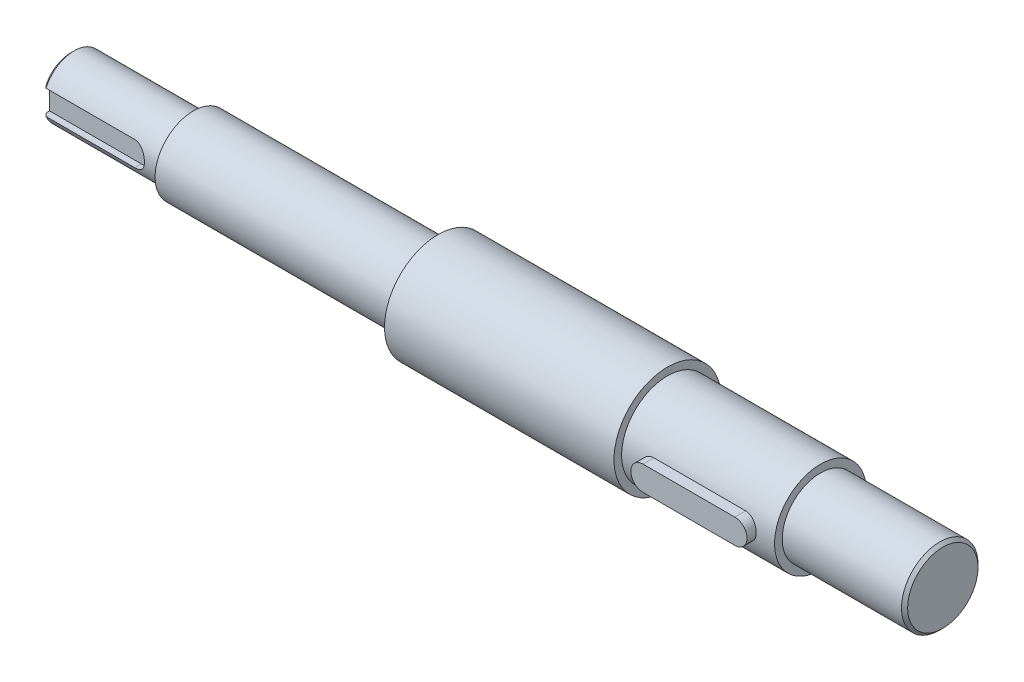
ISO-10303-21;
HEADER;
FILE_DESCRIPTION(('STEP AP214'),'2;1');
FILE_NAME('part.step','',(''),(''),'','','');
FILE_SCHEMA(('AUTOMOTIVE_DESIGN { 1 0 10303 214 1 1 1 1 }'));
ENDSEC;
DATA;
#1=APPLICATION_CONTEXT('core data for automotive mechanical design processes');
#2=APPLICATION_PROTOCOL_DEFINITION('international standard','automotive_design',2000,#1);
#3=PRODUCT_CONTEXT('',#1,'mechanical');
#4=PRODUCT('Part','Part','',(#3));
#5=PRODUCT_RELATED_PRODUCT_CATEGORY('part','',(#4));
#6=PRODUCT_DEFINITION_FORMATION('','',#4);
#7=PRODUCT_DEFINITION_CONTEXT('part definition',#1,'design');
#8=PRODUCT_DEFINITION('design','',#6,#7);
#9=PRODUCT_DEFINITION_SHAPE('','',#8);
#10=(LENGTH_UNIT() NAMED_UNIT(*) SI_UNIT(.MILLI.,.METRE.));
#11=(NAMED_UNIT(*) PLANE_ANGLE_UNIT() SI_UNIT($,.RADIAN.));
#12=(NAMED_UNIT(*) SI_UNIT($,.STERADIAN.) SOLID_ANGLE_UNIT());
#13=UNCERTAINTY_MEASURE_WITH_UNIT(LENGTH_MEASURE(1.E-05),#10,'distance_accuracy_value','');
#14=(GEOMETRIC_REPRESENTATION_CONTEXT(3) GLOBAL_UNCERTAINTY_ASSIGNED_CONTEXT((#13)) GLOBAL_UNIT_ASSIGNED_CONTEXT((#10,
#11,#12)) REPRESENTATION_CONTEXT('',''));
#15=CARTESIAN_POINT('',(0.,0.,0.));
#16=DIRECTION('',(0.,0.,1.));
#17=DIRECTION('',(1.,0.,0.));
#18=AXIS2_PLACEMENT_3D('',#15,#16,#17);
#19=CARTESIAN_POINT('',(285.,0.,0.));
#20=DIRECTION('',(1.,0.,0.));
#21=DIRECTION('',(0.,0.,-1.));
#22=AXIS2_PLACEMENT_3D('',#19,#20,#21);
#23=CYLINDRICAL_SURFACE('',#22,10.);
#24=CARTESIAN_POINT('',(40.,0.,0.));
#25=DIRECTION('',(1.,0.,0.));
#26=DIRECTION('',(0.,0.,-1.));
#27=AXIS2_PLACEMENT_3D('',#24,#25,#26);
#28=CIRCLE('',#27,10.);
#29=CARTESIAN_POINT('',(40.,0.,-10.));
#30=VERTEX_POINT('',#29);
#31=EDGE_CURVE('E182',#30,#30,#28,.T.);
#32=ORIENTED_EDGE('',*,*,#31,.F.);
#33=EDGE_LOOP('',(#32));
#34=FACE_BOUND('',#33,.T.);
#35=DIRECTION('',(1.,0.,0.));
#36=VECTOR('',#35,1.);
#37=CARTESIAN_POINT('',(285.,-3.99999999999998,9.16515138991169));
#38=LINE('',#37,#36);
#39=CARTESIAN_POINT('',(30.,-4.,9.16515138991168));
#40=VERTEX_POINT('',#39);
#41=CARTESIAN_POINT('',(1.,-3.99999999999998,9.16515138991169));
#42=VERTEX_POINT('',#41);
#43=EDGE_CURVE('E224',#40,#42,#38,.F.);
#44=ORIENTED_EDGE('',*,*,#43,.T.);
#45=CARTESIAN_POINT('',(1.,0.,0.));
#46=DIRECTION('',(1.,0.,0.));
#47=DIRECTION('',(0.,0.,-1.));
#48=AXIS2_PLACEMENT_3D('',#45,#46,#47);
#49=CIRCLE('',#48,10.);
#50=CARTESIAN_POINT('',(1.,4.00000000000002,9.16515138991167));
#51=VERTEX_POINT('',#50);
#52=EDGE_CURVE('E247',#42,#51,#49,.T.);
#53=ORIENTED_EDGE('',*,*,#52,.T.);
#54=DIRECTION('',(1.,0.,0.));
#55=VECTOR('',#54,1.);
#56=CARTESIAN_POINT('',(285.,4.00000000000002,9.16515138991167));
#57=LINE('',#56,#55);
#58=CARTESIAN_POINT('',(30.,4.,9.16515138991168));
#59=VERTEX_POINT('',#58);
#60=EDGE_CURVE('E258',#59,#51,#57,.F.);
#61=ORIENTED_EDGE('',*,*,#60,.F.);
#62=CARTESIAN_POINT('',(30.,4.,9.16515138991168));
#63=CARTESIAN_POINT('',(30.1076117050542,4.00001596071938,9.16512928809544));
#64=CARTESIAN_POINT('',(30.2152113311667,3.99565782731266,9.16704612011428));
#65=CARTESIAN_POINT('',(30.4295425965388,3.9783181194646,9.17459250745478));
#66=CARTESIAN_POINT('',(30.5362745507169,3.96533982937531,9.18022064873058));
#67=CARTESIAN_POINT('',(30.7476936431063,3.93095207352899,9.19499565865171));
#68=CARTESIAN_POINT('',(30.8523871680851,3.90957593640916,9.20412861441611));
#69=CARTESIAN_POINT('',(31.0594015434319,3.85863260381273,9.22560106586818));
#70=CARTESIAN_POINT('',(31.1617222485551,3.82906490834148,9.23794075728508));
#71=CARTESIAN_POINT('',(31.4638717011625,3.72853943587112,9.2791858250141));
#72=CARTESIAN_POINT('',(31.6593084613828,3.64568978920222,9.3123489831615));
#73=CARTESIAN_POINT('',(32.033591160162,3.45096383184147,9.38624741529469));
#74=CARTESIAN_POINT('',(32.2124211059086,3.33905992673094,9.42698987727426));
#75=CARTESIAN_POINT('',(32.558524793364,3.08263671474506,9.51401998804847));
#76=CARTESIAN_POINT('',(32.7247344339004,2.936738279885,9.56048491272144));
#77=CARTESIAN_POINT('',(33.0310805443615,2.61939292349378,9.65225581096199));
#78=CARTESIAN_POINT('',(33.1712116615072,2.44794076987998,9.69756154495612));
#79=CARTESIAN_POINT('',(33.4268127886245,2.07601181629753,9.78406834216145));
#80=CARTESIAN_POINT('',(33.5410896194102,1.87465586655102,9.82503649102096));
#81=CARTESIAN_POINT('',(33.7336881444914,1.45364828604452,9.89607888234979));
#82=CARTESIAN_POINT('',(33.8120248447933,1.23400433637531,9.92615767032247));
#83=CARTESIAN_POINT('',(33.9266824057709,0.793934884187373,9.97076629361036));
#84=CARTESIAN_POINT('',(33.9648539133031,0.574062114869023,9.98597845290694));
#85=CARTESIAN_POINT('',(34.0040569484035,0.130536855092205,10.001606202074));
#86=CARTESIAN_POINT('',(34.0051016332518,-0.0931142682526781,10.0020270338048));
#87=CARTESIAN_POINT('',(33.9710343620718,-0.524466731987232,9.98843920775428));
#88=CARTESIAN_POINT('',(33.9379500534468,-0.732358330632753,9.97523973659777));
#89=CARTESIAN_POINT('',(33.8400129990898,-1.13934964738689,9.93698538393897));
#90=CARTESIAN_POINT('',(33.7751584554296,-1.33844886722558,9.91192983148495));
#91=CARTESIAN_POINT('',(33.6147279622281,-1.72579479688349,9.85193670608706));
#92=CARTESIAN_POINT('',(33.518703604161,-1.91383264586891,9.81685584875391));
#93=CARTESIAN_POINT('',(33.2990687362952,-2.27161599563071,9.74029168639969));
#94=CARTESIAN_POINT('',(33.1754485485622,-2.4413550479227,9.69880613681324));
#95=CARTESIAN_POINT('',(32.8947199425636,-2.7695225783069,9.61043706268122));
#96=CARTESIAN_POINT('',(32.7359469828836,-2.92647922614483,9.56337795745419));
#97=CARTESIAN_POINT('',(32.3940078633372,-3.2122147086262,9.47123359153046));
#98=CARTESIAN_POINT('',(32.2108306512004,-3.34098070594789,9.42614923753061));
#99=CARTESIAN_POINT('',(31.9183643543766,-3.51186134851389,9.36326134539254));
#100=CARTESIAN_POINT('',(31.8163281616851,-3.56571263251516,9.34283170142194));
#101=CARTESIAN_POINT('',(31.6076076975908,-3.66454761505659,9.30450957703985));
#102=CARTESIAN_POINT('',(31.5009254542727,-3.70953513634086,9.28661600381593));
#103=CARTESIAN_POINT('',(31.2837710695037,-3.79016254319007,9.25400250539921));
#104=CARTESIAN_POINT('',(31.1733038299586,-3.82581403809398,9.23927864276951));
#105=CARTESIAN_POINT('',(30.9493316318513,-3.88744848158464,9.2135146773091));
#106=CARTESIAN_POINT('',(30.8358280597875,-3.91343576505911,9.20247292309662));
#107=CARTESIAN_POINT('',(30.6025545526625,-3.95619393609845,9.18417798205495));
#108=CARTESIAN_POINT('',(30.4827058054362,-3.97260125584169,9.17707470750587));
#109=CARTESIAN_POINT('',(30.241909070863,-3.99451448409732,9.16754485606458));
#110=CARTESIAN_POINT('',(30.1209618070773,-4.0000271099601,9.16511539745838));
#111=CARTESIAN_POINT('',(30.,-4.,9.16515138991168));
#112=B_SPLINE_CURVE_WITH_KNOTS('',3,(#62,#63,#64,#65,#66,#67,#68,#69,#70,#71,#72,#73,#74,#75,
#76,#77,#78,#79,#80,#81,#82,#83,#84,#85,#86,#87,#88,#89,#90,#91,#92,#93,#94,#95,#96,#97,#98,#99,
#100,#101,#102,#103,#104,#105,#106,#107,#108,#109,#110,#111),.UNSPECIFIED.,.F.,.F.,(4,2,2,2,2,2,
2,2,2,2,2,2,2,2,2,2,2,2,2,2,2,2,2,2,4),(0.,0.322709706217837,0.645296527806424,
0.966615822543771,1.28795473422462,1.9293660035182,2.57138869889252,3.24636095994997,
3.92147161082383,4.62325717855528,5.32474946398646,5.9922775301254,6.65956903033312,
7.28937830523071,7.91922322615309,8.55856353859094,9.19812842270038,9.87963749353246,
10.5614562641081,10.9125878460839,11.2635676597188,11.614108935291,11.964492785171,
12.3274303244848,12.6901440171997),.UNSPECIFIED.);
#113=EDGE_CURVE('E216',#59,#40,#112,.T.);
#114=ORIENTED_EDGE('',*,*,#113,.T.);
#115=EDGE_LOOP('',(#44,#53,#61,#114));
#116=FACE_BOUND('',#115,.T.);
#117=ADVANCED_FACE('F40',(#34,#116),#23,.T.);
#118=CARTESIAN_POINT('',(285.,0.,0.));
#119=DIRECTION('',(1.,0.,0.));
#120=DIRECTION('',(0.,0.,-1.));
#121=AXIS2_PLACEMENT_3D('',#118,#119,#120);
#122=CYLINDRICAL_SURFACE('',#121,15.);
#123=CARTESIAN_POINT('',(245.,0.,0.));
#124=DIRECTION('',(1.,0.,0.));
#125=DIRECTION('',(0.,0.,-1.));
#126=AXIS2_PLACEMENT_3D('',#123,#124,#125);
#127=CIRCLE('',#126,15.);
#128=CARTESIAN_POINT('',(245.,0.,-15.));
#129=VERTEX_POINT('',#128);
#130=EDGE_CURVE('E164',#129,#129,#127,.T.);
#131=ORIENTED_EDGE('',*,*,#130,.F.);
#132=EDGE_LOOP('',(#131));
#133=FACE_BOUND('',#132,.T.);
#134=CARTESIAN_POINT('',(195.,0.,0.));
#135=DIRECTION('',(1.,0.,0.));
#136=DIRECTION('',(0.,0.,-1.));
#137=AXIS2_PLACEMENT_3D('',#134,#135,#136);
#138=CIRCLE('',#137,15.);
#139=CARTESIAN_POINT('',(195.,0.,-15.));
#140=VERTEX_POINT('',#139);
#141=EDGE_CURVE('E167',#140,#140,#138,.T.);
#142=ORIENTED_EDGE('',*,*,#141,.T.);
#143=EDGE_LOOP('',(#142));
#144=FACE_BOUND('',#143,.T.);
#145=CARTESIAN_POINT('',(205.,3.99999999999996,14.456832294801));
#146=CARTESIAN_POINT('',(204.889641756596,4.0000130938917,14.4568189842467));
#147=CARTESIAN_POINT('',(204.779291478007,3.99543311151599,14.4580956467717));
#148=CARTESIAN_POINT('',(204.559421346034,3.97718874589721,14.4631301353517));
#149=CARTESIAN_POINT('',(204.44990134224,3.9635260498392,14.4668875005959));
#150=CARTESIAN_POINT('',(204.232698346486,3.92725695741258,14.4767740441059));
#151=CARTESIAN_POINT('',(204.125011912152,3.90466984692441,14.482898107258));
#152=CARTESIAN_POINT('',(203.912025139644,3.85076543838179,14.4973231400467));
#153=CARTESIAN_POINT('',(203.806724843415,3.81944798699433,14.5056241479174));
#154=CARTESIAN_POINT('',(203.495536581225,3.71275643853682,14.5334412456827));
#155=CARTESIAN_POINT('',(203.294125066453,3.62460332607931,14.5558829598252));
#156=CARTESIAN_POINT('',(202.908979240374,3.41695780475814,14.6060171290377));
#157=CARTESIAN_POINT('',(202.725250796028,3.29745504324301,14.6337113178035));
#158=CARTESIAN_POINT('',(202.376029423072,3.02730320878005,14.6920016406366));
#159=CARTESIAN_POINT('',(202.211038159034,2.87601544465614,14.7226489452442));
#160=CARTESIAN_POINT('',(201.908442433038,2.54795832924024,14.7829523618628));
#161=CARTESIAN_POINT('',(201.770842417132,2.37118484921245,14.8126083123117));
#162=CARTESIAN_POINT('',(201.524827869815,1.99367199592152,14.8681604116921));
#163=CARTESIAN_POINT('',(201.416916034422,1.79259414843391,14.8939887414057));
#164=CARTESIAN_POINT('',(201.236627111039,1.37435575552785,14.9383834129136));
#165=CARTESIAN_POINT('',(201.164242355223,1.15719869214841,14.9569513215518));
#166=CARTESIAN_POINT('',(201.058690174831,0.718234307369618,14.9843709217852));
#167=CARTESIAN_POINT('',(201.024662787106,0.496647293428053,14.9934353394138));
#168=CARTESIAN_POINT('',(200.994085686777,0.0507319917605263,15.0015705103632));
#169=CARTESIAN_POINT('',(200.997530515807,-0.173595891963505,15.0006427191926));
#170=CARTESIAN_POINT('',(201.041195686368,-0.612629502642218,14.9890534931377));
#171=CARTESIAN_POINT('',(201.080486127656,-0.827435206418371,14.9786381919443));
#172=CARTESIAN_POINT('',(201.193225150863,-1.2472846766511,14.9495347795913));
#173=CARTESIAN_POINT('',(201.266675352151,-1.4523279798058,14.9308462762364));
#174=CARTESIAN_POINT('',(201.446359966253,-1.8492096354536,14.8869312076945));
#175=CARTESIAN_POINT('',(201.55291337223,-2.04089626466621,14.8616414267933));
#176=CARTESIAN_POINT('',(201.795542768965,-2.40398441957152,14.8072486052897));
#177=CARTESIAN_POINT('',(201.931623922183,-2.57538239000355,14.7781448982353));
#178=CARTESIAN_POINT('',(202.234327971101,-2.89854935036785,14.7182294237973));
#179=CARTESIAN_POINT('',(202.401758007894,-3.04955722400813,14.6873926412643));
#180=CARTESIAN_POINT('',(202.760042840709,-3.32161448391787,14.6282716207252));
#181=CARTESIAN_POINT('',(202.950904096481,-3.44265558078025,14.5999880903709));
#182=CARTESIAN_POINT('',(203.251353283365,-3.59932937334138,14.5618587427771));
#183=CARTESIAN_POINT('',(203.354288915041,-3.64754371945353,14.5498268172621));
#184=CARTESIAN_POINT('',(203.564046321272,-3.73509417643332,14.5275984074125));
#185=CARTESIAN_POINT('',(203.670866512463,-3.77443385857869,14.5174011851057));
#186=CARTESIAN_POINT('',(203.88751941922,-3.84386783810506,14.4991713081511));
#187=CARTESIAN_POINT('',(203.997348878193,-3.87397173088609,14.4911364080612));
#188=CARTESIAN_POINT('',(204.219275221125,-3.92471856960779,14.4774747012191));
#189=CARTESIAN_POINT('',(204.33137102282,-3.94536592495324,14.4718467722231));
#190=CARTESIAN_POINT('',(204.536251024718,-3.97411378733406,14.4639761334309));
#191=CARTESIAN_POINT('',(204.628796446167,-3.9838231996078,14.4613012625133));
#192=CARTESIAN_POINT('',(204.81422535331,-3.99676420153359,14.4577275048596));
#193=CARTESIAN_POINT('',(204.907108070432,-4.00000603663188,14.4568258092259));
#194=CARTESIAN_POINT('',(205.,-4.00000000000004,14.456832294801));
#195=B_SPLINE_CURVE_WITH_KNOTS('',3,(#145,#146,#147,#148,#149,#150,#151,#152,#153,#154,#155,
#156,#157,#158,#159,#160,#161,#162,#163,#164,#165,#166,#167,#168,#169,#170,#171,#172,#173,#174,
#175,#176,#177,#178,#179,#180,#181,#182,#183,#184,#185,#186,#187,#188,#189,#190,#191,#192,#193,
#194),.UNSPECIFIED.,.F.,.F.,(4,2,2,2,2,2,2,2,2,2,2,2,2,2,2,2,2,2,2,2,2,2,2,2,4),(0.,
0.330958670878079,0.661855880768538,0.992041890688624,1.32223370010826,1.98190700187187,
2.64179842357633,3.31649637536151,3.9913037526112,4.67691814590526,5.36238449759353,
6.03215661862345,6.70183117906691,7.35461236515047,8.00742449996359,8.66673340793705,
9.32615767867959,10.005759878567,10.6855498604333,11.0281077435251,11.3705275300853,
11.7125903499582,12.0544935096115,12.3335333037377,12.6121307120356),.UNSPECIFIED.);
#196=CARTESIAN_POINT('',(205.,3.99999999999996,14.456832294801));
#197=VERTEX_POINT('',#196);
#198=CARTESIAN_POINT('',(205.,-4.00000000000004,14.456832294801));
#199=VERTEX_POINT('',#198);
#200=EDGE_CURVE('E185',#197,#199,#195,.T.);
#201=ORIENTED_EDGE('',*,*,#200,.F.);
#202=DIRECTION('',(1.,0.,0.));
#203=VECTOR('',#202,1.);
#204=CARTESIAN_POINT('',(285.,3.99999999999992,14.456832294801));
#205=LINE('',#204,#203);
#206=CARTESIAN_POINT('',(235.,3.99999999999995,14.456832294801));
#207=VERTEX_POINT('',#206);
#208=EDGE_CURVE('E214',#207,#197,#205,.F.);
#209=ORIENTED_EDGE('',*,*,#208,.F.);
#210=CARTESIAN_POINT('',(235.,-4.00000000000005,14.456832294801));
#211=CARTESIAN_POINT('',(235.110358243404,-4.0000130938918,14.4568189842467));
#212=CARTESIAN_POINT('',(235.220708521993,-3.99543311151609,14.4580956467717));
#213=CARTESIAN_POINT('',(235.440578653966,-3.97718874589731,14.4631301353516));
#214=CARTESIAN_POINT('',(235.55009865776,-3.96352604983929,14.4668875005959));
#215=CARTESIAN_POINT('',(235.767301653514,-3.92725695741268,14.4767740441058));
#216=CARTESIAN_POINT('',(235.874988087848,-3.90466984692452,14.482898107258));
#217=CARTESIAN_POINT('',(236.087974860356,-3.8507654383819,14.4973231400467));
#218=CARTESIAN_POINT('',(236.193275156585,-3.81944798699443,14.5056241479174));
#219=CARTESIAN_POINT('',(236.504463418775,-3.71275643853691,14.5334412456827));
#220=CARTESIAN_POINT('',(236.705874933547,-3.6246033260794,14.5558829598252));
#221=CARTESIAN_POINT('',(237.091020759626,-3.41695780475824,14.6060171290377));
#222=CARTESIAN_POINT('',(237.274749203972,-3.29745504324311,14.6337113178035));
#223=CARTESIAN_POINT('',(237.623970576928,-3.02730320878014,14.6920016406366));
#224=CARTESIAN_POINT('',(237.788961840966,-2.87601544465623,14.7226489452442));
#225=CARTESIAN_POINT('',(238.091557566962,-2.54795832924033,14.7829523618628));
#226=CARTESIAN_POINT('',(238.229157582868,-2.37118484921254,14.8126083123117));
#227=CARTESIAN_POINT('',(238.475172130185,-1.99367199592161,14.8681604116921));
#228=CARTESIAN_POINT('',(238.583083965578,-1.79259414843401,14.8939887414057));
#229=CARTESIAN_POINT('',(238.763372888961,-1.37435575552795,14.9383834129136));
#230=CARTESIAN_POINT('',(238.835757644777,-1.15719869214851,14.9569513215518));
#231=CARTESIAN_POINT('',(238.941309825169,-0.71823430736971,14.9843709217852));
#232=CARTESIAN_POINT('',(238.975337212894,-0.496647293428146,14.9934353394137));
#233=CARTESIAN_POINT('',(239.005914313223,-0.0507319917606185,15.0015705103632));
#234=CARTESIAN_POINT('',(239.002469484193,0.173595891963414,15.0006427191926));
#235=CARTESIAN_POINT('',(238.958804313632,0.612629502642128,14.9890534931377));
#236=CARTESIAN_POINT('',(238.919513872344,0.827435206418281,14.9786381919443));
#237=CARTESIAN_POINT('',(238.806774849137,1.24728467665101,14.9495347795913));
#238=CARTESIAN_POINT('',(238.733324647849,1.45232797980571,14.9308462762364));
#239=CARTESIAN_POINT('',(238.553640033747,1.84920963545351,14.8869312076945));
#240=CARTESIAN_POINT('',(238.44708662777,2.04089626466612,14.8616414267933));
#241=CARTESIAN_POINT('',(238.204457231035,2.40398441957143,14.8072486052897));
#242=CARTESIAN_POINT('',(238.068376077817,2.57538239000346,14.7781448982353));
#243=CARTESIAN_POINT('',(237.765672028899,2.89854935036776,14.7182294237973));
#244=CARTESIAN_POINT('',(237.598241992106,3.04955722400804,14.6873926412644));
#245=CARTESIAN_POINT('',(237.239957159291,3.32161448391778,14.6282716207252));
#246=CARTESIAN_POINT('',(237.049095903519,3.44265558078016,14.5999880903709));
#247=CARTESIAN_POINT('',(236.748646716635,3.59932937334129,14.5618587427771));
#248=CARTESIAN_POINT('',(236.645711084959,3.64754371945343,14.5498268172621));
#249=CARTESIAN_POINT('',(236.435953678728,3.73509417643322,14.5275984074126));
#250=CARTESIAN_POINT('',(236.329133487537,3.77443385857859,14.5174011851057));
#251=CARTESIAN_POINT('',(236.11248058078,3.84386783810496,14.4991713081511));
#252=CARTESIAN_POINT('',(236.002651121807,3.87397173088598,14.4911364080612));
#253=CARTESIAN_POINT('',(235.780724778875,3.92471856960769,14.4774747012192));
#254=CARTESIAN_POINT('',(235.66862897718,3.94536592495314,14.4718467722231));
#255=CARTESIAN_POINT('',(235.463748975282,3.97411378733397,14.4639761334309));
#256=CARTESIAN_POINT('',(235.371203553833,3.98382319960771,14.4613012625134));
#257=CARTESIAN_POINT('',(235.18577464669,3.9967642015335,14.4577275048596));
#258=CARTESIAN_POINT('',(235.092891929568,4.00000603663178,14.4568258092259));
#259=CARTESIAN_POINT('',(235.,3.99999999999995,14.456832294801));
#260=B_SPLINE_CURVE_WITH_KNOTS('',3,(#210,#211,#212,#213,#214,#215,#216,#217,#218,#219,#220,
#221,#222,#223,#224,#225,#226,#227,#228,#229,#230,#231,#232,#233,#234,#235,#236,#237,#238,#239,
#240,#241,#242,#243,#244,#245,#246,#247,#248,#249,#250,#251,#252,#253,#254,#255,#256,#257,#258,
#259),.UNSPECIFIED.,.F.,.F.,(4,2,2,2,2,2,2,2,2,2,2,2,2,2,2,2,2,2,2,2,2,2,2,2,4),(0.,
0.330958670878051,0.66185588076851,0.992041890688566,1.32223370010826,1.98190700187181,
2.64179842357633,3.31649637536151,3.9913037526112,4.67691814590525,5.36238449759353,
6.03215661862345,6.70183117906692,7.35461236515047,8.00742449996359,8.66673340793705,
9.32615767867959,10.005759878567,10.6855498604333,11.0281077435251,11.3705275300853,
11.7125903499582,12.0544935096115,12.3335333037377,12.6121307120356),.UNSPECIFIED.);
#261=CARTESIAN_POINT('',(235.,-4.00000000000005,14.456832294801));
#262=VERTEX_POINT('',#261);
#263=EDGE_CURVE('E139',#262,#207,#260,.T.);
#264=ORIENTED_EDGE('',*,*,#263,.F.);
#265=DIRECTION('',(1.,0.,0.));
#266=VECTOR('',#265,1.);
#267=CARTESIAN_POINT('',(285.,-4.00000000000008,14.4568322948009));
#268=LINE('',#267,#266);
#269=EDGE_CURVE('E194',#262,#199,#268,.F.);
#270=ORIENTED_EDGE('',*,*,#269,.T.);
#271=EDGE_LOOP('',(#201,#209,#264,#270));
#272=FACE_BOUND('',#271,.T.);
#273=ADVANCED_FACE('F196',(#133,#144,#272),#122,.T.);
#274=CARTESIAN_POINT('',(0.,0.,0.));
#275=DIRECTION('',(1.,0.,0.));
#276=DIRECTION('',(0.,0.,-1.));
#277=AXIS2_PLACEMENT_3D('',#274,#275,#276);
#278=PLANE('',#277);
#279=DIRECTION('',(0.,0.,-1.));
#280=VECTOR('',#279,1.);
#281=CARTESIAN_POINT('',(0.,4.,0.));
#282=LINE('',#281,#280);
#283=CARTESIAN_POINT('',(0.,4.,8.06225774829853));
#284=VERTEX_POINT('',#283);
#285=CARTESIAN_POINT('',(0.,4.,7.));
#286=VERTEX_POINT('',#285);
#287=EDGE_CURVE('E156',#284,#286,#282,.T.);
#288=ORIENTED_EDGE('',*,*,#287,.F.);
#289=CARTESIAN_POINT('',(0.,0.,0.));
#290=DIRECTION('',(1.,0.,0.));
#291=DIRECTION('',(0.,0.,-1.));
#292=AXIS2_PLACEMENT_3D('',#289,#290,#291);
#293=CIRCLE('',#292,8.99999999999998);
#294=CARTESIAN_POINT('',(0.,-4.,8.06225774829853));
#295=VERTEX_POINT('',#294);
#296=EDGE_CURVE('E55',#284,#295,#293,.F.);
#297=ORIENTED_EDGE('',*,*,#296,.T.);
#298=DIRECTION('',(0.,0.,-1.));
#299=VECTOR('',#298,1.);
#300=CARTESIAN_POINT('',(0.,-4.,0.));
#301=LINE('',#300,#299);
#302=CARTESIAN_POINT('',(0.,-4.,7.));
#303=VERTEX_POINT('',#302);
#304=EDGE_CURVE('E159',#295,#303,#301,.T.);
#305=ORIENTED_EDGE('',*,*,#304,.T.);
#306=DIRECTION('',(0.,-1.,0.));
#307=VECTOR('',#306,1.);
#308=CARTESIAN_POINT('',(0.,0.,7.));
#309=LINE('',#308,#307);
#310=EDGE_CURVE('E256',#286,#303,#309,.T.);
#311=ORIENTED_EDGE('',*,*,#310,.F.);
#312=EDGE_LOOP('',(#288,#297,#305,#311));
#313=FACE_BOUND('',#312,.T.);
#314=ADVANCED_FACE('F270',(#313),#278,.F.);
#315=CARTESIAN_POINT('',(40.,0.,10.));
#316=DIRECTION('',(1.,0.,0.));
#317=DIRECTION('',(0.,0.,-1.));
#318=AXIS2_PLACEMENT_3D('',#315,#316,#317);
#319=PLANE('',#318);
#320=CARTESIAN_POINT('',(40.,0.,0.));
#321=DIRECTION('',(1.,0.,0.));
#322=DIRECTION('',(0.,0.,-1.));
#323=AXIS2_PLACEMENT_3D('',#320,#321,#322);
#324=CIRCLE('',#323,12.5);
#325=CARTESIAN_POINT('',(40.,0.,-12.5));
#326=VERTEX_POINT('',#325);
#327=EDGE_CURVE('E179',#326,#326,#324,.T.);
#328=ORIENTED_EDGE('',*,*,#327,.F.);
#329=EDGE_LOOP('',(#328));
#330=FACE_BOUND('',#329,.T.);
#331=ORIENTED_EDGE('',*,*,#31,.T.);
#332=EDGE_LOOP('',(#331));
#333=FACE_BOUND('',#332,.T.);
#334=ADVANCED_FACE('F290',(#330,#333),#319,.F.);
#335=CARTESIAN_POINT('',(285.,0.,0.));
#336=DIRECTION('',(1.,0.,0.));
#337=DIRECTION('',(0.,0.,-1.));
#338=AXIS2_PLACEMENT_3D('',#335,#336,#337);
#339=CYLINDRICAL_SURFACE('',#338,12.5);
#340=CARTESIAN_POINT('',(120.,0.,0.));
#341=DIRECTION('',(1.,0.,0.));
#342=DIRECTION('',(0.,0.,-1.));
#343=AXIS2_PLACEMENT_3D('',#340,#341,#342);
#344=CIRCLE('',#343,12.5);
#345=CARTESIAN_POINT('',(120.,0.,-12.5));
#346=VERTEX_POINT('',#345);
#347=EDGE_CURVE('E176',#346,#346,#344,.T.);
#348=ORIENTED_EDGE('',*,*,#347,.F.);
#349=EDGE_LOOP('',(#348));
#350=FACE_BOUND('',#349,.T.);
#351=ORIENTED_EDGE('',*,*,#327,.T.);
#352=EDGE_LOOP('',(#351));
#353=FACE_BOUND('',#352,.T.);
#354=ADVANCED_FACE('F292',(#350,#353),#339,.T.);
#355=CARTESIAN_POINT('',(120.,0.,12.5));
#356=DIRECTION('',(1.,0.,0.));
#357=DIRECTION('',(0.,0.,-1.));
#358=AXIS2_PLACEMENT_3D('',#355,#356,#357);
#359=PLANE('',#358);
#360=CARTESIAN_POINT('',(120.,0.,0.));
#361=DIRECTION('',(1.,0.,0.));
#362=DIRECTION('',(0.,0.,-1.));
#363=AXIS2_PLACEMENT_3D('',#360,#361,#362);
#364=CIRCLE('',#363,17.5);
#365=CARTESIAN_POINT('',(120.,0.,-17.5));
#366=VERTEX_POINT('',#365);
#367=EDGE_CURVE('E173',#366,#366,#364,.T.);
#368=ORIENTED_EDGE('',*,*,#367,.F.);
#369=EDGE_LOOP('',(#368));
#370=FACE_BOUND('',#369,.T.);
#371=ORIENTED_EDGE('',*,*,#347,.T.);
#372=EDGE_LOOP('',(#371));
#373=FACE_BOUND('',#372,.T.);
#374=ADVANCED_FACE('F298',(#370,#373),#359,.F.);
#375=CARTESIAN_POINT('',(285.,0.,0.));
#376=DIRECTION('',(1.,0.,0.));
#377=DIRECTION('',(0.,0.,-1.));
#378=AXIS2_PLACEMENT_3D('',#375,#376,#377);
#379=CYLINDRICAL_SURFACE('',#378,17.5);
#380=CARTESIAN_POINT('',(195.,0.,0.));
#381=DIRECTION('',(1.,0.,0.));
#382=DIRECTION('',(0.,0.,-1.));
#383=AXIS2_PLACEMENT_3D('',#380,#381,#382);
#384=CIRCLE('',#383,17.5);
#385=CARTESIAN_POINT('',(195.,0.,-17.5));
#386=VERTEX_POINT('',#385);
#387=EDGE_CURVE('E170',#386,#386,#384,.T.);
#388=ORIENTED_EDGE('',*,*,#387,.F.);
#389=EDGE_LOOP('',(#388));
#390=FACE_BOUND('',#389,.T.);
#391=ORIENTED_EDGE('',*,*,#367,.T.);
#392=EDGE_LOOP('',(#391));
#393=FACE_BOUND('',#392,.T.);
#394=ADVANCED_FACE('F305',(#390,#393),#379,.T.);
#395=CARTESIAN_POINT('',(195.,0.,17.5));
#396=DIRECTION('',(-1.,0.,0.));
#397=DIRECTION('',(0.,0.,1.));
#398=AXIS2_PLACEMENT_3D('',#395,#396,#397);
#399=PLANE('',#398);
#400=ORIENTED_EDGE('',*,*,#141,.F.);
#401=EDGE_LOOP('',(#400));
#402=FACE_BOUND('',#401,.T.);
#403=ORIENTED_EDGE('',*,*,#387,.T.);
#404=EDGE_LOOP('',(#403));
#405=FACE_BOUND('',#404,.T.);
#406=ADVANCED_FACE('F308',(#402,#405),#399,.F.);
#407=CARTESIAN_POINT('',(245.,0.,15.));
#408=DIRECTION('',(-1.,0.,0.));
#409=DIRECTION('',(0.,0.,1.));
#410=AXIS2_PLACEMENT_3D('',#407,#408,#409);
#411=PLANE('',#410);
#412=CARTESIAN_POINT('',(245.,0.,0.));
#413=DIRECTION('',(1.,0.,0.));
#414=DIRECTION('',(0.,0.,-1.));
#415=AXIS2_PLACEMENT_3D('',#412,#413,#414);
#416=CIRCLE('',#415,12.5);
#417=CARTESIAN_POINT('',(245.,0.,-12.5));
#418=VERTEX_POINT('',#417);
#419=EDGE_CURVE('E161',#418,#418,#416,.T.);
#420=ORIENTED_EDGE('',*,*,#419,.F.);
#421=EDGE_LOOP('',(#420));
#422=FACE_BOUND('',#421,.T.);
#423=ORIENTED_EDGE('',*,*,#130,.T.);
#424=EDGE_LOOP('',(#423));
#425=FACE_BOUND('',#424,.T.);
#426=ADVANCED_FACE('F311',(#422,#425),#411,.F.);
#427=CARTESIAN_POINT('',(285.,0.,0.));
#428=DIRECTION('',(1.,0.,0.));
#429=DIRECTION('',(0.,0.,-1.));
#430=AXIS2_PLACEMENT_3D('',#427,#428,#429);
#431=CYLINDRICAL_SURFACE('',#430,12.5);
#432=CARTESIAN_POINT('',(284.,0.,0.));
#433=DIRECTION('',(-1.,0.,0.));
#434=DIRECTION('',(0.,0.,1.));
#435=AXIS2_PLACEMENT_3D('',#432,#433,#434);
#436=CIRCLE('',#435,12.5);
#437=CARTESIAN_POINT('',(284.,0.,12.5));
#438=VERTEX_POINT('',#437);
#439=EDGE_CURVE('E250',#438,#438,#436,.T.);
#440=ORIENTED_EDGE('',*,*,#439,.T.);
#441=EDGE_LOOP('',(#440));
#442=FACE_BOUND('',#441,.T.);
#443=ORIENTED_EDGE('',*,*,#419,.T.);
#444=EDGE_LOOP('',(#443));
#445=FACE_BOUND('',#444,.T.);
#446=ADVANCED_FACE('F280',(#442,#445),#431,.T.);
#447=CARTESIAN_POINT('',(285.,0.,12.5));
#448=DIRECTION('',(-1.,0.,0.));
#449=DIRECTION('',(0.,0.,1.));
#450=AXIS2_PLACEMENT_3D('',#447,#448,#449);
#451=PLANE('',#450);
#452=CARTESIAN_POINT('',(285.,0.,0.));
#453=DIRECTION('',(-1.,0.,0.));
#454=DIRECTION('',(0.,0.,1.));
#455=AXIS2_PLACEMENT_3D('',#452,#453,#454);
#456=CIRCLE('',#455,11.5);
#457=CARTESIAN_POINT('',(285.,0.,11.5));
#458=VERTEX_POINT('',#457);
#459=EDGE_CURVE('E253',#458,#458,#456,.F.);
#460=ORIENTED_EDGE('',*,*,#459,.T.);
#461=EDGE_LOOP('',(#460));
#462=FACE_BOUND('',#461,.T.);
#463=ADVANCED_FACE('F207',(#462),#451,.F.);
#464=CARTESIAN_POINT('',(0.,0.,7.));
#465=DIRECTION('',(0.,0.,1.));
#466=DIRECTION('',(1.,0.,0.));
#467=AXIS2_PLACEMENT_3D('',#464,#465,#466);
#468=PLANE('',#467);
#469=ORIENTED_EDGE('',*,*,#310,.T.);
#470=DIRECTION('',(1.,0.,0.));
#471=VECTOR('',#470,1.);
#472=CARTESIAN_POINT('',(0.,-4.,7.));
#473=LINE('',#472,#471);
#474=CARTESIAN_POINT('',(30.,-4.,7.));
#475=VERTEX_POINT('',#474);
#476=EDGE_CURVE('E140',#303,#475,#473,.T.);
#477=ORIENTED_EDGE('',*,*,#476,.T.);
#478=CARTESIAN_POINT('',(30.,0.,7.));
#479=DIRECTION('',(0.,0.,1.));
#480=DIRECTION('',(1.,0.,0.));
#481=AXIS2_PLACEMENT_3D('',#478,#479,#480);
#482=CIRCLE('',#481,4.);
#483=CARTESIAN_POINT('',(30.,4.,7.));
#484=VERTEX_POINT('',#483);
#485=EDGE_CURVE('E142',#475,#484,#482,.T.);
#486=ORIENTED_EDGE('',*,*,#485,.T.);
#487=DIRECTION('',(1.,0.,0.));
#488=VECTOR('',#487,1.);
#489=CARTESIAN_POINT('',(0.,4.,7.));
#490=LINE('',#489,#488);
#491=EDGE_CURVE('E150',#286,#484,#490,.T.);
#492=ORIENTED_EDGE('',*,*,#491,.F.);
#493=EDGE_LOOP('',(#469,#477,#486,#492));
#494=FACE_BOUND('',#493,.T.);
#495=ADVANCED_FACE('F239',(#494),#468,.T.);
#496=CARTESIAN_POINT('',(0.,-4.,7.));
#497=DIRECTION('',(0.,-1.,0.));
#498=DIRECTION('',(1.,0.,0.));
#499=AXIS2_PLACEMENT_3D('',#496,#497,#498);
#500=PLANE('',#499);
#501=ORIENTED_EDGE('',*,*,#304,.F.);
#502=CARTESIAN_POINT('',(0.,-4.,8.06225774829853));
#503=CARTESIAN_POINT('',(0.0827804610894062,-4.,8.15466558707243));
#504=CARTESIAN_POINT('',(0.165715779423333,-4.,8.24693455312825));
#505=CARTESIAN_POINT('',(0.331870129840305,-4.,8.43121535839556));
#506=CARTESIAN_POINT('',(0.415089159636971,-4.,8.52322719966835));
#507=CARTESIAN_POINT('',(0.581786164707575,-4.,8.70701574953846));
#508=CARTESIAN_POINT('',(0.665264139672477,-4.,8.79879245841617));
#509=CARTESIAN_POINT('',(0.832458626856683,-4.,8.98212970779841));
#510=CARTESIAN_POINT('',(0.916175140987763,-4.,9.07369024655963));
#511=CARTESIAN_POINT('',(1.00000000000001,-4.,9.16515138991169));
#512=B_SPLINE_CURVE_WITH_KNOTS('',3,(#502,#503,#504,#505,#506,#507,#508,#509,#510,#511),
.UNSPECIFIED.,.F.,.F.,(4,2,2,2,4),(0.,0.372190907821795,0.744378823279496,1.11656629472139,
1.48875675749996),.UNSPECIFIED.);
#513=EDGE_CURVE('E11',#295,#42,#512,.T.);
#514=ORIENTED_EDGE('',*,*,#513,.T.);
#515=ORIENTED_EDGE('',*,*,#43,.F.);
#516=DIRECTION('',(0.,0.,1.));
#517=VECTOR('',#516,1.);
#518=CARTESIAN_POINT('',(30.,-4.,7.));
#519=LINE('',#518,#517);
#520=EDGE_CURVE('E152',#475,#40,#519,.T.);
#521=ORIENTED_EDGE('',*,*,#520,.F.);
#522=ORIENTED_EDGE('',*,*,#476,.F.);
#523=EDGE_LOOP('',(#501,#514,#515,#521,#522));
#524=FACE_BOUND('',#523,.T.);
#525=ADVANCED_FACE('F202',(#524),#500,.F.);
#526=CARTESIAN_POINT('',(0.,4.,7.));
#527=DIRECTION('',(0.,-1.,0.));
#528=DIRECTION('',(1.,0.,0.));
#529=AXIS2_PLACEMENT_3D('',#526,#527,#528);
#530=PLANE('',#529);
#531=ORIENTED_EDGE('',*,*,#60,.T.);
#532=CARTESIAN_POINT('',(1.,4.00000000000002,9.16515138991167));
#533=CARTESIAN_POINT('',(0.916175140987757,4.00000000000001,9.07369024655962));
#534=CARTESIAN_POINT('',(0.832458626856678,4.,8.9821297077984));
#535=CARTESIAN_POINT('',(0.665264139672472,4.,8.79879245841616));
#536=CARTESIAN_POINT('',(0.581786164707571,4.,8.70701574953846));
#537=CARTESIAN_POINT('',(0.415089159636967,4.,8.52322719966834));
#538=CARTESIAN_POINT('',(0.331870129840303,4.,8.43121535839555));
#539=CARTESIAN_POINT('',(0.165715779423331,4.,8.24693455312825));
#540=CARTESIAN_POINT('',(0.0827804610894054,4.,8.15466558707243));
#541=CARTESIAN_POINT('',(0.,4.,8.06225774829853));
#542=B_SPLINE_CURVE_WITH_KNOTS('',3,(#532,#533,#534,#535,#536,#537,#538,#539,#540,#541),
.UNSPECIFIED.,.F.,.F.,(4,2,2,2,4),(0.,0.372190462778561,0.744377934220455,1.11656584967815,
1.48875675749994),.UNSPECIFIED.);
#543=EDGE_CURVE('E69',#51,#284,#542,.T.);
#544=ORIENTED_EDGE('',*,*,#543,.T.);
#545=ORIENTED_EDGE('',*,*,#287,.T.);
#546=ORIENTED_EDGE('',*,*,#491,.T.);
#547=DIRECTION('',(0.,0.,1.));
#548=VECTOR('',#547,1.);
#549=CARTESIAN_POINT('',(30.,4.,7.));
#550=LINE('',#549,#548);
#551=EDGE_CURVE('E153',#484,#59,#550,.T.);
#552=ORIENTED_EDGE('',*,*,#551,.T.);
#553=EDGE_LOOP('',(#531,#544,#545,#546,#552));
#554=FACE_BOUND('',#553,.T.);
#555=ADVANCED_FACE('F234',(#554),#530,.T.);
#556=CARTESIAN_POINT('',(30.,0.,7.));
#557=DIRECTION('',(0.,0.,1.));
#558=DIRECTION('',(1.,0.,0.));
#559=AXIS2_PLACEMENT_3D('',#556,#557,#558);
#560=CYLINDRICAL_SURFACE('',#559,4.);
#561=ORIENTED_EDGE('',*,*,#551,.F.);
#562=ORIENTED_EDGE('',*,*,#485,.F.);
#563=ORIENTED_EDGE('',*,*,#520,.T.);
#564=ORIENTED_EDGE('',*,*,#113,.F.);
#565=EDGE_LOOP('',(#561,#562,#563,#564));
#566=FACE_BOUND('',#565,.T.);
#567=ADVANCED_FACE('F229',(#566),#560,.F.);
#568=CARTESIAN_POINT('',(285.,0.,0.));
#569=DIRECTION('',(-1.,0.,0.));
#570=DIRECTION('',(0.,0.,1.));
#571=AXIS2_PLACEMENT_3D('',#568,#569,#570);
#572=CONICAL_SURFACE('',#571,11.5,0.785398163397434);
#573=ORIENTED_EDGE('',*,*,#439,.F.);
#574=EDGE_LOOP('',(#573));
#575=FACE_BOUND('',#574,.T.);
#576=ORIENTED_EDGE('',*,*,#459,.F.);
#577=EDGE_LOOP('',(#576));
#578=FACE_BOUND('',#577,.T.);
#579=ADVANCED_FACE('F233',(#575,#578),#572,.T.);
#580=CARTESIAN_POINT('',(1.,0.,0.));
#581=DIRECTION('',(1.,0.,0.));
#582=DIRECTION('',(0.,0.,-1.));
#583=AXIS2_PLACEMENT_3D('',#580,#581,#582);
#584=CONICAL_SURFACE('',#583,10.,0.785398163397458);
#585=ORIENTED_EDGE('',*,*,#513,.F.);
#586=ORIENTED_EDGE('',*,*,#296,.F.);
#587=ORIENTED_EDGE('',*,*,#543,.F.);
#588=ORIENTED_EDGE('',*,*,#52,.F.);
#589=EDGE_LOOP('',(#585,#586,#587,#588));
#590=FACE_BOUND('',#589,.T.);
#591=ADVANCED_FACE('F43',(#590),#584,.T.);
#592=CARTESIAN_POINT('',(235.,0.,18.));
#593=DIRECTION('',(0.,0.,-1.));
#594=DIRECTION('',(-1.,0.,0.));
#595=AXIS2_PLACEMENT_3D('',#592,#593,#594);
#596=CYLINDRICAL_SURFACE('',#595,4.);
#597=DIRECTION('',(0.,0.,-1.));
#598=VECTOR('',#597,1.);
#599=CARTESIAN_POINT('',(235.,-4.00000000000005,18.));
#600=LINE('',#599,#598);
#601=CARTESIAN_POINT('',(235.,-4.00000000000005,18.));
#602=VERTEX_POINT('',#601);
#603=EDGE_CURVE('E333',#602,#262,#600,.T.);
#604=ORIENTED_EDGE('',*,*,#603,.T.);
#605=ORIENTED_EDGE('',*,*,#263,.T.);
#606=DIRECTION('',(0.,0.,-1.));
#607=VECTOR('',#606,1.);
#608=CARTESIAN_POINT('',(235.,3.99999999999995,18.));
#609=LINE('',#608,#607);
#610=CARTESIAN_POINT('',(235.,3.99999999999995,18.));
#611=VERTEX_POINT('',#610);
#612=EDGE_CURVE('E120',#611,#207,#609,.T.);
#613=ORIENTED_EDGE('',*,*,#612,.F.);
#614=CARTESIAN_POINT('',(235.,0.,18.));
#615=DIRECTION('',(0.,0.,1.));
#616=DIRECTION('',(1.,0.,0.));
#617=AXIS2_PLACEMENT_3D('',#614,#615,#616);
#618=CIRCLE('',#617,4.);
#619=EDGE_CURVE('E127',#602,#611,#618,.T.);
#620=ORIENTED_EDGE('',*,*,#619,.F.);
#621=EDGE_LOOP('',(#604,#605,#613,#620));
#622=FACE_BOUND('',#621,.T.);
#623=ADVANCED_FACE('F137',(#622),#596,.T.);
#624=CARTESIAN_POINT('',(235.,3.99999999999995,18.));
#625=DIRECTION('',(0.,-1.,0.));
#626=DIRECTION('',(1.,0.,0.));
#627=AXIS2_PLACEMENT_3D('',#624,#625,#626);
#628=PLANE('',#627);
#629=ORIENTED_EDGE('',*,*,#612,.T.);
#630=ORIENTED_EDGE('',*,*,#208,.T.);
#631=DIRECTION('',(0.,0.,-1.));
#632=VECTOR('',#631,1.);
#633=CARTESIAN_POINT('',(205.,3.99999999999996,18.));
#634=LINE('',#633,#632);
#635=CARTESIAN_POINT('',(205.,3.99999999999996,18.));
#636=VERTEX_POINT('',#635);
#637=EDGE_CURVE('E123',#636,#197,#634,.T.);
#638=ORIENTED_EDGE('',*,*,#637,.F.);
#639=DIRECTION('',(-1.,0.,0.));
#640=VECTOR('',#639,1.);
#641=CARTESIAN_POINT('',(235.,3.99999999999995,18.));
#642=LINE('',#641,#640);
#643=EDGE_CURVE('E116',#611,#636,#642,.T.);
#644=ORIENTED_EDGE('',*,*,#643,.F.);
#645=EDGE_LOOP('',(#629,#630,#638,#644));
#646=FACE_BOUND('',#645,.T.);
#647=ADVANCED_FACE('F118',(#646),#628,.F.);
#648=CARTESIAN_POINT('',(205.,0.,18.));
#649=DIRECTION('',(0.,0.,-1.));
#650=DIRECTION('',(-1.,0.,0.));
#651=AXIS2_PLACEMENT_3D('',#648,#649,#650);
#652=CYLINDRICAL_SURFACE('',#651,4.);
#653=ORIENTED_EDGE('',*,*,#637,.T.);
#654=ORIENTED_EDGE('',*,*,#200,.T.);
#655=DIRECTION('',(0.,0.,-1.));
#656=VECTOR('',#655,1.);
#657=CARTESIAN_POINT('',(205.,-4.00000000000004,18.));
#658=LINE('',#657,#656);
#659=CARTESIAN_POINT('',(205.,-4.00000000000004,18.));
#660=VERTEX_POINT('',#659);
#661=EDGE_CURVE('E144',#660,#199,#658,.T.);
#662=ORIENTED_EDGE('',*,*,#661,.F.);
#663=CARTESIAN_POINT('',(205.,0.,18.));
#664=DIRECTION('',(0.,0.,1.));
#665=DIRECTION('',(1.,0.,0.));
#666=AXIS2_PLACEMENT_3D('',#663,#664,#665);
#667=CIRCLE('',#666,4.);
#668=EDGE_CURVE('E126',#636,#660,#667,.T.);
#669=ORIENTED_EDGE('',*,*,#668,.F.);
#670=EDGE_LOOP('',(#653,#654,#662,#669));
#671=FACE_BOUND('',#670,.T.);
#672=ADVANCED_FACE('F331',(#671),#652,.T.);
#673=CARTESIAN_POINT('',(205.,-4.00000000000004,18.));
#674=DIRECTION('',(0.,1.,0.));
#675=DIRECTION('',(-1.,0.,0.));
#676=AXIS2_PLACEMENT_3D('',#673,#674,#675);
#677=PLANE('',#676);
#678=ORIENTED_EDGE('',*,*,#661,.T.);
#679=ORIENTED_EDGE('',*,*,#269,.F.);
#680=ORIENTED_EDGE('',*,*,#603,.F.);
#681=DIRECTION('',(1.,0.,0.));
#682=VECTOR('',#681,1.);
#683=CARTESIAN_POINT('',(205.,-4.00000000000004,18.));
#684=LINE('',#683,#682);
#685=EDGE_CURVE('E132',#660,#602,#684,.T.);
#686=ORIENTED_EDGE('',*,*,#685,.F.);
#687=EDGE_LOOP('',(#678,#679,#680,#686));
#688=FACE_BOUND('',#687,.T.);
#689=ADVANCED_FACE('F337',(#688),#677,.F.);
#690=CARTESIAN_POINT('',(235.,0.,18.));
#691=DIRECTION('',(0.,0.,1.));
#692=DIRECTION('',(1.,0.,0.));
#693=AXIS2_PLACEMENT_3D('',#690,#691,#692);
#694=PLANE('',#693);
#695=ORIENTED_EDGE('',*,*,#619,.T.);
#696=ORIENTED_EDGE('',*,*,#643,.T.);
#697=ORIENTED_EDGE('',*,*,#668,.T.);
#698=ORIENTED_EDGE('',*,*,#685,.T.);
#699=EDGE_LOOP('',(#695,#696,#697,#698));
#700=FACE_BOUND('',#699,.T.);
#701=ADVANCED_FACE('F130',(#700),#694,.T.);
#702=CLOSED_SHELL('',(#117,#273,#314,#334,#354,#374,#394,#406,#426,#446,#463,#495,#525,#555,
#567,#579,#591,#623,#647,#672,#689,#701));
#703=MANIFOLD_SOLID_BREP('B2',#702);
#704=ADVANCED_BREP_SHAPE_REPRESENTATION('',(#18,#703),#14);
#705=SHAPE_DEFINITION_REPRESENTATION(#9,#704);
ENDSEC;
END-ISO-10303-21;
